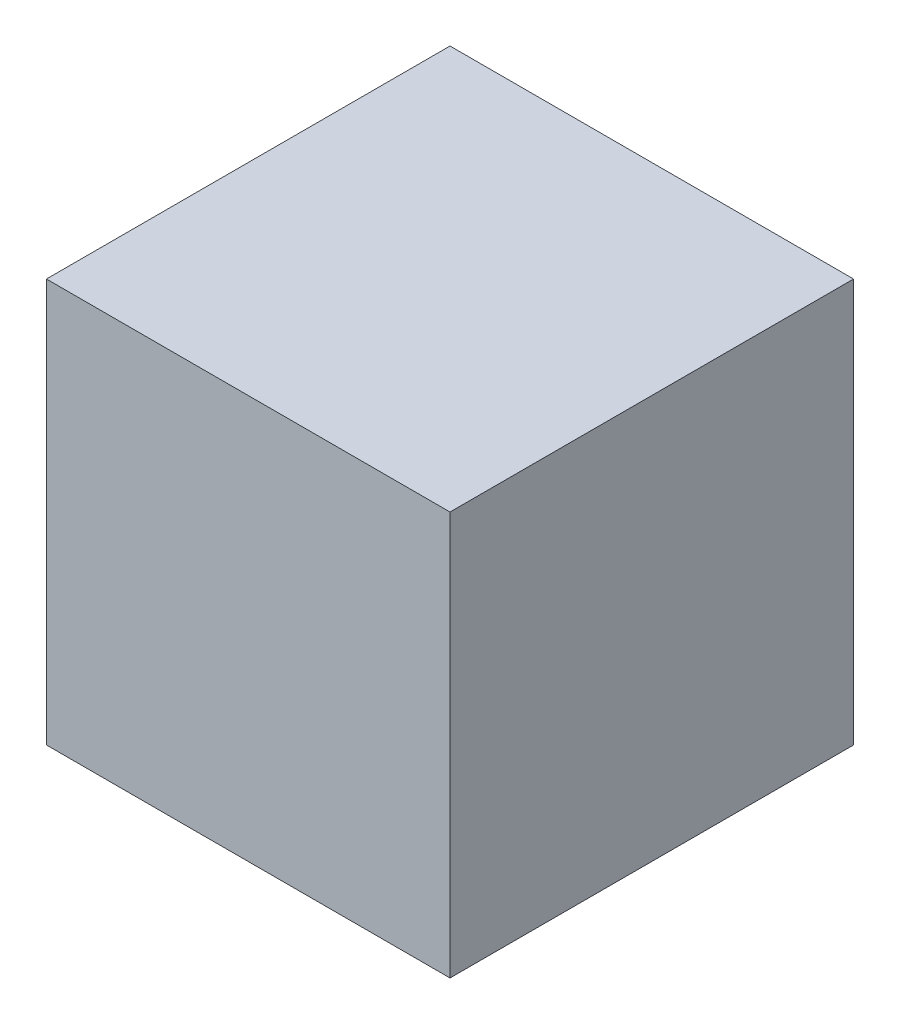
ISO-10303-21;
HEADER;
FILE_DESCRIPTION(('STEP AP214'),'2;1');
FILE_NAME('part.step','',(''),(''),'','','');
FILE_SCHEMA(('AUTOMOTIVE_DESIGN { 1 0 10303 214 1 1 1 1 }'));
ENDSEC;
DATA;
#1=APPLICATION_CONTEXT('core data for automotive mechanical design processes');
#2=APPLICATION_PROTOCOL_DEFINITION('international standard','automotive_design',2000,#1);
#3=PRODUCT_CONTEXT('',#1,'mechanical');
#4=PRODUCT('Part','Part','',(#3));
#5=PRODUCT_RELATED_PRODUCT_CATEGORY('part','',(#4));
#6=PRODUCT_DEFINITION_FORMATION('','',#4);
#7=PRODUCT_DEFINITION_CONTEXT('part definition',#1,'design');
#8=PRODUCT_DEFINITION('design','',#6,#7);
#9=PRODUCT_DEFINITION_SHAPE('','',#8);
#10=(LENGTH_UNIT() NAMED_UNIT(*) SI_UNIT(.MILLI.,.METRE.));
#11=(NAMED_UNIT(*) PLANE_ANGLE_UNIT() SI_UNIT($,.RADIAN.));
#12=(NAMED_UNIT(*) SI_UNIT($,.STERADIAN.) SOLID_ANGLE_UNIT());
#13=UNCERTAINTY_MEASURE_WITH_UNIT(LENGTH_MEASURE(1.E-05),#10,'distance_accuracy_value','');
#14=(GEOMETRIC_REPRESENTATION_CONTEXT(3) GLOBAL_UNCERTAINTY_ASSIGNED_CONTEXT((#13)) GLOBAL_UNIT_ASSIGNED_CONTEXT((#10,
#11,#12)) REPRESENTATION_CONTEXT('',''));
#15=CARTESIAN_POINT('',(0.,0.,0.));
#16=DIRECTION('',(0.,0.,1.));
#17=DIRECTION('',(1.,0.,0.));
#18=AXIS2_PLACEMENT_3D('',#15,#16,#17);
#19=CARTESIAN_POINT('',(-28.5,28.5,57.));
#20=DIRECTION('',(1.,0.,0.));
#21=DIRECTION('',(0.,1.,0.));
#22=AXIS2_PLACEMENT_3D('',#19,#20,#21);
#23=PLANE('',#22);
#24=DIRECTION('',(0.,-1.,0.));
#25=VECTOR('',#24,1.);
#26=CARTESIAN_POINT('',(-28.5,28.5,0.));
#27=LINE('',#26,#25);
#28=CARTESIAN_POINT('',(-28.5,28.5,0.));
#29=VERTEX_POINT('',#28);
#30=CARTESIAN_POINT('',(-28.5,-28.5,0.));
#31=VERTEX_POINT('',#30);
#32=EDGE_CURVE('E100',#29,#31,#27,.T.);
#33=ORIENTED_EDGE('',*,*,#32,.T.);
#34=DIRECTION('',(0.,0.,-1.));
#35=VECTOR('',#34,1.);
#36=CARTESIAN_POINT('',(-28.5,-28.5,57.));
#37=LINE('',#36,#35);
#38=CARTESIAN_POINT('',(-28.5,-28.5,57.));
#39=VERTEX_POINT('',#38);
#40=EDGE_CURVE('E11',#39,#31,#37,.T.);
#41=ORIENTED_EDGE('',*,*,#40,.F.);
#42=DIRECTION('',(0.,-1.,0.));
#43=VECTOR('',#42,1.);
#44=CARTESIAN_POINT('',(-28.5,28.5,57.));
#45=LINE('',#44,#43);
#46=CARTESIAN_POINT('',(-28.5,28.5,57.));
#47=VERTEX_POINT('',#46);
#48=EDGE_CURVE('E88',#47,#39,#45,.T.);
#49=ORIENTED_EDGE('',*,*,#48,.F.);
#50=DIRECTION('',(0.,0.,-1.));
#51=VECTOR('',#50,1.);
#52=CARTESIAN_POINT('',(-28.5,28.5,57.));
#53=LINE('',#52,#51);
#54=EDGE_CURVE('E96',#47,#29,#53,.T.);
#55=ORIENTED_EDGE('',*,*,#54,.T.);
#56=EDGE_LOOP('',(#33,#41,#49,#55));
#57=FACE_BOUND('',#56,.T.);
#58=ADVANCED_FACE('F37',(#57),#23,.F.);
#59=CARTESIAN_POINT('',(-28.5,-28.5,57.));
#60=DIRECTION('',(0.,1.,0.));
#61=DIRECTION('',(0.,0.,1.));
#62=AXIS2_PLACEMENT_3D('',#59,#60,#61);
#63=PLANE('',#62);
#64=DIRECTION('',(1.,0.,0.));
#65=VECTOR('',#64,1.);
#66=CARTESIAN_POINT('',(-28.5,-28.5,0.));
#67=LINE('',#66,#65);
#68=CARTESIAN_POINT('',(28.5,-28.5,0.));
#69=VERTEX_POINT('',#68);
#70=EDGE_CURVE('E92',#31,#69,#67,.T.);
#71=ORIENTED_EDGE('',*,*,#70,.T.);
#72=DIRECTION('',(0.,0.,-1.));
#73=VECTOR('',#72,1.);
#74=CARTESIAN_POINT('',(28.5,-28.5,57.));
#75=LINE('',#74,#73);
#76=CARTESIAN_POINT('',(28.5,-28.5,57.));
#77=VERTEX_POINT('',#76);
#78=EDGE_CURVE('E45',#77,#69,#75,.T.);
#79=ORIENTED_EDGE('',*,*,#78,.F.);
#80=DIRECTION('',(1.,0.,0.));
#81=VECTOR('',#80,1.);
#82=CARTESIAN_POINT('',(-28.5,-28.5,57.));
#83=LINE('',#82,#81);
#84=EDGE_CURVE('E83',#39,#77,#83,.T.);
#85=ORIENTED_EDGE('',*,*,#84,.F.);
#86=ORIENTED_EDGE('',*,*,#40,.T.);
#87=EDGE_LOOP('',(#71,#79,#85,#86));
#88=FACE_BOUND('',#87,.T.);
#89=ADVANCED_FACE('F91',(#88),#63,.F.);
#90=CARTESIAN_POINT('',(28.5,28.5,57.));
#91=DIRECTION('',(-1.,0.,0.));
#92=DIRECTION('',(0.,-1.,0.));
#93=AXIS2_PLACEMENT_3D('',#90,#91,#92);
#94=PLANE('',#93);
#95=DIRECTION('',(0.,1.,0.));
#96=VECTOR('',#95,1.);
#97=CARTESIAN_POINT('',(28.5,28.5,0.));
#98=LINE('',#97,#96);
#99=CARTESIAN_POINT('',(28.5,28.5,0.));
#100=VERTEX_POINT('',#99);
#101=EDGE_CURVE('E70',#69,#100,#98,.T.);
#102=ORIENTED_EDGE('',*,*,#101,.T.);
#103=DIRECTION('',(0.,0.,-1.));
#104=VECTOR('',#103,1.);
#105=CARTESIAN_POINT('',(28.5,28.5,57.));
#106=LINE('',#105,#104);
#107=CARTESIAN_POINT('',(28.5,28.5,57.));
#108=VERTEX_POINT('',#107);
#109=EDGE_CURVE('E93',#108,#100,#106,.T.);
#110=ORIENTED_EDGE('',*,*,#109,.F.);
#111=DIRECTION('',(0.,1.,0.));
#112=VECTOR('',#111,1.);
#113=CARTESIAN_POINT('',(28.5,28.5,57.));
#114=LINE('',#113,#112);
#115=EDGE_CURVE('E86',#77,#108,#114,.T.);
#116=ORIENTED_EDGE('',*,*,#115,.F.);
#117=ORIENTED_EDGE('',*,*,#78,.T.);
#118=EDGE_LOOP('',(#102,#110,#116,#117));
#119=FACE_BOUND('',#118,.T.);
#120=ADVANCED_FACE('F94',(#119),#94,.F.);
#121=CARTESIAN_POINT('',(-28.5,28.5,57.));
#122=DIRECTION('',(0.,-1.,0.));
#123=DIRECTION('',(1.,0.,0.));
#124=AXIS2_PLACEMENT_3D('',#121,#122,#123);
#125=PLANE('',#124);
#126=DIRECTION('',(-1.,0.,0.));
#127=VECTOR('',#126,1.);
#128=CARTESIAN_POINT('',(-28.5,28.5,0.));
#129=LINE('',#128,#127);
#130=EDGE_CURVE('E76',#100,#29,#129,.T.);
#131=ORIENTED_EDGE('',*,*,#130,.T.);
#132=ORIENTED_EDGE('',*,*,#54,.F.);
#133=DIRECTION('',(-1.,0.,0.));
#134=VECTOR('',#133,1.);
#135=CARTESIAN_POINT('',(-28.5,28.5,57.));
#136=LINE('',#135,#134);
#137=EDGE_CURVE('E53',#108,#47,#136,.T.);
#138=ORIENTED_EDGE('',*,*,#137,.F.);
#139=ORIENTED_EDGE('',*,*,#109,.T.);
#140=EDGE_LOOP('',(#131,#132,#138,#139));
#141=FACE_BOUND('',#140,.T.);
#142=ADVANCED_FACE('F107',(#141),#125,.F.);
#143=CARTESIAN_POINT('',(0.,0.,57.));
#144=DIRECTION('',(0.,0.,1.));
#145=DIRECTION('',(1.,0.,0.));
#146=AXIS2_PLACEMENT_3D('',#143,#144,#145);
#147=PLANE('',#146);
#148=ORIENTED_EDGE('',*,*,#48,.T.);
#149=ORIENTED_EDGE('',*,*,#84,.T.);
#150=ORIENTED_EDGE('',*,*,#115,.T.);
#151=ORIENTED_EDGE('',*,*,#137,.T.);
#152=EDGE_LOOP('',(#148,#149,#150,#151));
#153=FACE_BOUND('',#152,.T.);
#154=ADVANCED_FACE('F84',(#153),#147,.T.);
#155=CARTESIAN_POINT('',(0.,0.,0.));
#156=DIRECTION('',(0.,0.,1.));
#157=DIRECTION('',(1.,0.,0.));
#158=AXIS2_PLACEMENT_3D('',#155,#156,#157);
#159=PLANE('',#158);
#160=ORIENTED_EDGE('',*,*,#32,.F.);
#161=ORIENTED_EDGE('',*,*,#130,.F.);
#162=ORIENTED_EDGE('',*,*,#101,.F.);
#163=ORIENTED_EDGE('',*,*,#70,.F.);
#164=EDGE_LOOP('',(#160,#161,#162,#163));
#165=FACE_BOUND('',#164,.T.);
#166=ADVANCED_FACE('F110',(#165),#159,.F.);
#167=CLOSED_SHELL('',(#58,#89,#120,#142,#154,#166));
#168=MANIFOLD_SOLID_BREP('B2',#167);
#169=ADVANCED_BREP_SHAPE_REPRESENTATION('',(#18,#168),#14);
#170=SHAPE_DEFINITION_REPRESENTATION(#9,#169);
ENDSEC;
END-ISO-10303-21;
